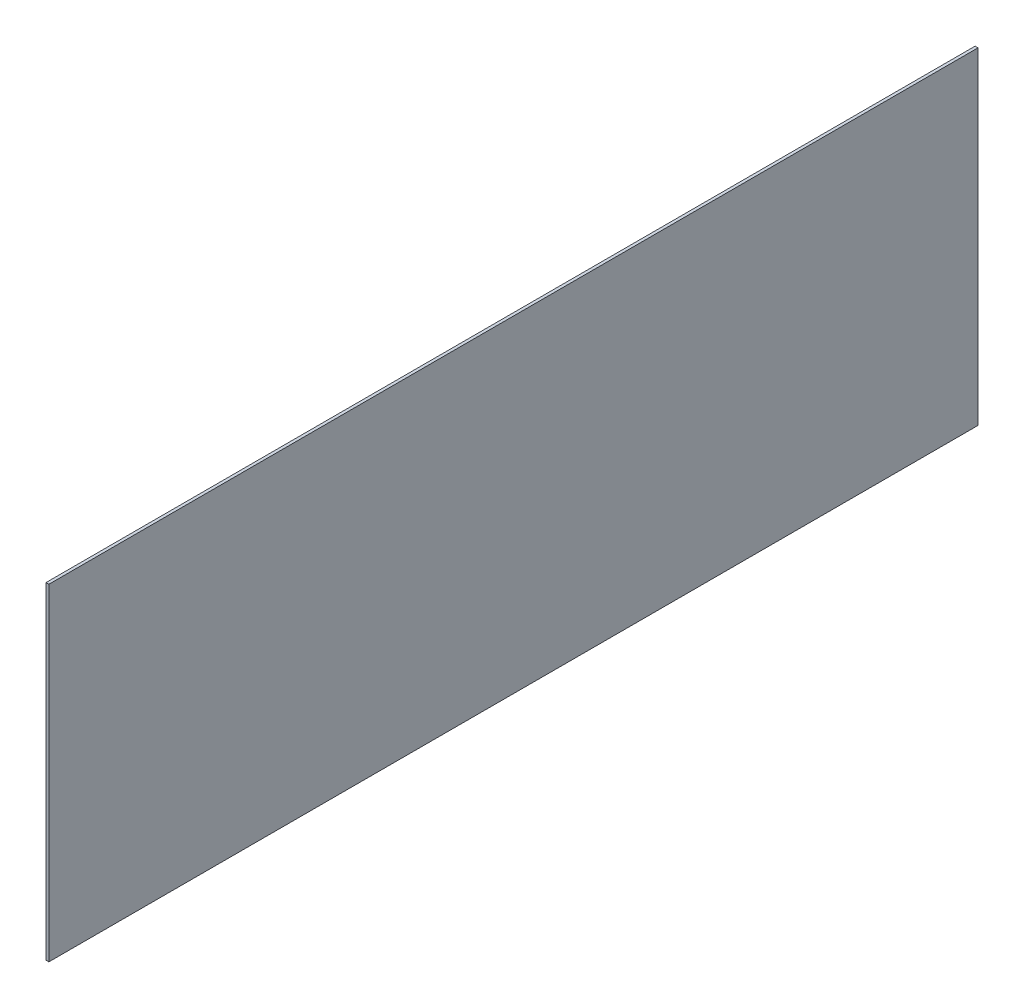
ISO-10303-21;
HEADER;
FILE_DESCRIPTION(('STEP AP214'),'2;1');
FILE_NAME('part.step','',(''),(''),'','','');
FILE_SCHEMA(('AUTOMOTIVE_DESIGN { 1 0 10303 214 1 1 1 1 }'));
ENDSEC;
DATA;
#1=APPLICATION_CONTEXT('core data for automotive mechanical design processes');
#2=APPLICATION_PROTOCOL_DEFINITION('international standard','automotive_design',2000,#1);
#3=PRODUCT_CONTEXT('',#1,'mechanical');
#4=PRODUCT('Part','Part','',(#3));
#5=PRODUCT_RELATED_PRODUCT_CATEGORY('part','',(#4));
#6=PRODUCT_DEFINITION_FORMATION('','',#4);
#7=PRODUCT_DEFINITION_CONTEXT('part definition',#1,'design');
#8=PRODUCT_DEFINITION('design','',#6,#7);
#9=PRODUCT_DEFINITION_SHAPE('','',#8);
#10=(LENGTH_UNIT() NAMED_UNIT(*) SI_UNIT(.MILLI.,.METRE.));
#11=(NAMED_UNIT(*) PLANE_ANGLE_UNIT() SI_UNIT($,.RADIAN.));
#12=(NAMED_UNIT(*) SI_UNIT($,.STERADIAN.) SOLID_ANGLE_UNIT());
#13=UNCERTAINTY_MEASURE_WITH_UNIT(LENGTH_MEASURE(1.E-05),#10,'distance_accuracy_value','');
#14=(GEOMETRIC_REPRESENTATION_CONTEXT(3) GLOBAL_UNCERTAINTY_ASSIGNED_CONTEXT((#13)) GLOBAL_UNIT_ASSIGNED_CONTEXT((#10,
#11,#12)) REPRESENTATION_CONTEXT('',''));
#15=CARTESIAN_POINT('',(0.,0.,0.));
#16=DIRECTION('',(0.,0.,1.));
#17=DIRECTION('',(1.,0.,0.));
#18=AXIS2_PLACEMENT_3D('',#15,#16,#17);
#19=CARTESIAN_POINT('',(1.5875,-89.408,-254.));
#20=DIRECTION('',(0.,0.,1.));
#21=DIRECTION('',(1.,0.,0.));
#22=AXIS2_PLACEMENT_3D('',#19,#20,#21);
#23=PLANE('',#22);
#24=DIRECTION('',(0.,1.,0.));
#25=VECTOR('',#24,1.);
#26=CARTESIAN_POINT('',(0.,-89.408,-254.));
#27=LINE('',#26,#25);
#28=CARTESIAN_POINT('',(0.,-89.408,-254.));
#29=VERTEX_POINT('',#28);
#30=CARTESIAN_POINT('',(0.,89.408,-254.));
#31=VERTEX_POINT('',#30);
#32=EDGE_CURVE('E99',#29,#31,#27,.T.);
#33=ORIENTED_EDGE('',*,*,#32,.T.);
#34=DIRECTION('',(-1.,0.,0.));
#35=VECTOR('',#34,1.);
#36=CARTESIAN_POINT('',(1.5875,89.408,-254.));
#37=LINE('',#36,#35);
#38=CARTESIAN_POINT('',(1.5875,89.408,-254.));
#39=VERTEX_POINT('',#38);
#40=EDGE_CURVE('E11',#39,#31,#37,.T.);
#41=ORIENTED_EDGE('',*,*,#40,.F.);
#42=DIRECTION('',(0.,1.,0.));
#43=VECTOR('',#42,1.);
#44=CARTESIAN_POINT('',(1.5875,-89.408,-254.));
#45=LINE('',#44,#43);
#46=CARTESIAN_POINT('',(1.5875,-89.408,-254.));
#47=VERTEX_POINT('',#46);
#48=EDGE_CURVE('E87',#47,#39,#45,.T.);
#49=ORIENTED_EDGE('',*,*,#48,.F.);
#50=DIRECTION('',(-1.,0.,0.));
#51=VECTOR('',#50,1.);
#52=CARTESIAN_POINT('',(1.5875,-89.408,-254.));
#53=LINE('',#52,#51);
#54=EDGE_CURVE('E95',#47,#29,#53,.T.);
#55=ORIENTED_EDGE('',*,*,#54,.T.);
#56=EDGE_LOOP('',(#33,#41,#49,#55));
#57=FACE_BOUND('',#56,.T.);
#58=ADVANCED_FACE('F36',(#57),#23,.F.);
#59=CARTESIAN_POINT('',(1.5875,89.408,254.));
#60=DIRECTION('',(0.,-1.,0.));
#61=DIRECTION('',(0.,0.,-1.));
#62=AXIS2_PLACEMENT_3D('',#59,#60,#61);
#63=PLANE('',#62);
#64=DIRECTION('',(0.,0.,1.));
#65=VECTOR('',#64,1.);
#66=CARTESIAN_POINT('',(0.,89.408,254.));
#67=LINE('',#66,#65);
#68=CARTESIAN_POINT('',(0.,89.408,254.));
#69=VERTEX_POINT('',#68);
#70=EDGE_CURVE('E91',#31,#69,#67,.T.);
#71=ORIENTED_EDGE('',*,*,#70,.T.);
#72=DIRECTION('',(-1.,0.,0.));
#73=VECTOR('',#72,1.);
#74=CARTESIAN_POINT('',(1.5875,89.408,254.));
#75=LINE('',#74,#73);
#76=CARTESIAN_POINT('',(1.5875,89.408,254.));
#77=VERTEX_POINT('',#76);
#78=EDGE_CURVE('E44',#77,#69,#75,.T.);
#79=ORIENTED_EDGE('',*,*,#78,.F.);
#80=DIRECTION('',(0.,0.,1.));
#81=VECTOR('',#80,1.);
#82=CARTESIAN_POINT('',(1.5875,89.408,254.));
#83=LINE('',#82,#81);
#84=EDGE_CURVE('E82',#39,#77,#83,.T.);
#85=ORIENTED_EDGE('',*,*,#84,.F.);
#86=ORIENTED_EDGE('',*,*,#40,.T.);
#87=EDGE_LOOP('',(#71,#79,#85,#86));
#88=FACE_BOUND('',#87,.T.);
#89=ADVANCED_FACE('F90',(#88),#63,.F.);
#90=CARTESIAN_POINT('',(1.5875,-89.408,254.));
#91=DIRECTION('',(0.,0.,-1.));
#92=DIRECTION('',(-1.,0.,0.));
#93=AXIS2_PLACEMENT_3D('',#90,#91,#92);
#94=PLANE('',#93);
#95=DIRECTION('',(0.,-1.,0.));
#96=VECTOR('',#95,1.);
#97=CARTESIAN_POINT('',(0.,-89.408,254.));
#98=LINE('',#97,#96);
#99=CARTESIAN_POINT('',(0.,-89.408,254.));
#100=VERTEX_POINT('',#99);
#101=EDGE_CURVE('E69',#69,#100,#98,.T.);
#102=ORIENTED_EDGE('',*,*,#101,.T.);
#103=DIRECTION('',(-1.,0.,0.));
#104=VECTOR('',#103,1.);
#105=CARTESIAN_POINT('',(1.5875,-89.408,254.));
#106=LINE('',#105,#104);
#107=CARTESIAN_POINT('',(1.5875,-89.408,254.));
#108=VERTEX_POINT('',#107);
#109=EDGE_CURVE('E92',#108,#100,#106,.T.);
#110=ORIENTED_EDGE('',*,*,#109,.F.);
#111=DIRECTION('',(0.,-1.,0.));
#112=VECTOR('',#111,1.);
#113=CARTESIAN_POINT('',(1.5875,-89.408,254.));
#114=LINE('',#113,#112);
#115=EDGE_CURVE('E85',#77,#108,#114,.T.);
#116=ORIENTED_EDGE('',*,*,#115,.F.);
#117=ORIENTED_EDGE('',*,*,#78,.T.);
#118=EDGE_LOOP('',(#102,#110,#116,#117));
#119=FACE_BOUND('',#118,.T.);
#120=ADVANCED_FACE('F93',(#119),#94,.F.);
#121=CARTESIAN_POINT('',(1.5875,-89.408,254.));
#122=DIRECTION('',(0.,1.,0.));
#123=DIRECTION('',(0.,0.,1.));
#124=AXIS2_PLACEMENT_3D('',#121,#122,#123);
#125=PLANE('',#124);
#126=DIRECTION('',(0.,0.,-1.));
#127=VECTOR('',#126,1.);
#128=CARTESIAN_POINT('',(0.,-89.408,254.));
#129=LINE('',#128,#127);
#130=EDGE_CURVE('E75',#100,#29,#129,.T.);
#131=ORIENTED_EDGE('',*,*,#130,.T.);
#132=ORIENTED_EDGE('',*,*,#54,.F.);
#133=DIRECTION('',(0.,0.,-1.));
#134=VECTOR('',#133,1.);
#135=CARTESIAN_POINT('',(1.5875,-89.408,254.));
#136=LINE('',#135,#134);
#137=EDGE_CURVE('E52',#108,#47,#136,.T.);
#138=ORIENTED_EDGE('',*,*,#137,.F.);
#139=ORIENTED_EDGE('',*,*,#109,.T.);
#140=EDGE_LOOP('',(#131,#132,#138,#139));
#141=FACE_BOUND('',#140,.T.);
#142=ADVANCED_FACE('F106',(#141),#125,.F.);
#143=CARTESIAN_POINT('',(1.5875,0.,0.));
#144=DIRECTION('',(-1.,0.,0.));
#145=DIRECTION('',(0.,0.,1.));
#146=AXIS2_PLACEMENT_3D('',#143,#144,#145);
#147=PLANE('',#146);
#148=ORIENTED_EDGE('',*,*,#48,.T.);
#149=ORIENTED_EDGE('',*,*,#84,.T.);
#150=ORIENTED_EDGE('',*,*,#115,.T.);
#151=ORIENTED_EDGE('',*,*,#137,.T.);
#152=EDGE_LOOP('',(#148,#149,#150,#151));
#153=FACE_BOUND('',#152,.T.);
#154=ADVANCED_FACE('F83',(#153),#147,.F.);
#155=CARTESIAN_POINT('',(0.,0.,0.));
#156=DIRECTION('',(-1.,0.,0.));
#157=DIRECTION('',(0.,0.,1.));
#158=AXIS2_PLACEMENT_3D('',#155,#156,#157);
#159=PLANE('',#158);
#160=ORIENTED_EDGE('',*,*,#32,.F.);
#161=ORIENTED_EDGE('',*,*,#130,.F.);
#162=ORIENTED_EDGE('',*,*,#101,.F.);
#163=ORIENTED_EDGE('',*,*,#70,.F.);
#164=EDGE_LOOP('',(#160,#161,#162,#163));
#165=FACE_BOUND('',#164,.T.);
#166=ADVANCED_FACE('F109',(#165),#159,.T.);
#167=CLOSED_SHELL('',(#58,#89,#120,#142,#154,#166));
#168=MANIFOLD_SOLID_BREP('B2',#167);
#169=ADVANCED_BREP_SHAPE_REPRESENTATION('',(#18,#168),#14);
#170=SHAPE_DEFINITION_REPRESENTATION(#9,#169);
ENDSEC;
END-ISO-10303-21;
